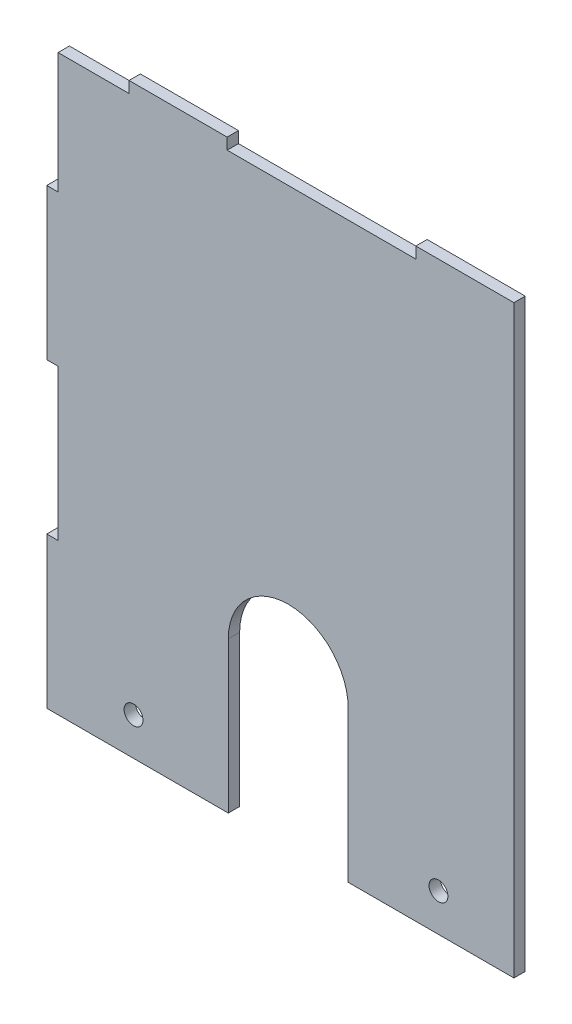
ISO-10303-21;
HEADER;
FILE_DESCRIPTION(('STEP AP214'),'2;1');
FILE_NAME('part.step','',(''),(''),'','','');
FILE_SCHEMA(('AUTOMOTIVE_DESIGN { 1 0 10303 214 1 1 1 1 }'));
ENDSEC;
DATA;
#1=APPLICATION_CONTEXT('core data for automotive mechanical design processes');
#2=APPLICATION_PROTOCOL_DEFINITION('international standard','automotive_design',2000,#1);
#3=PRODUCT_CONTEXT('',#1,'mechanical');
#4=PRODUCT('Part','Part','',(#3));
#5=PRODUCT_RELATED_PRODUCT_CATEGORY('part','',(#4));
#6=PRODUCT_DEFINITION_FORMATION('','',#4);
#7=PRODUCT_DEFINITION_CONTEXT('part definition',#1,'design');
#8=PRODUCT_DEFINITION('design','',#6,#7);
#9=PRODUCT_DEFINITION_SHAPE('','',#8);
#10=(LENGTH_UNIT() NAMED_UNIT(*) SI_UNIT(.MILLI.,.METRE.));
#11=(NAMED_UNIT(*) PLANE_ANGLE_UNIT() SI_UNIT($,.RADIAN.));
#12=(NAMED_UNIT(*) SI_UNIT($,.STERADIAN.) SOLID_ANGLE_UNIT());
#13=UNCERTAINTY_MEASURE_WITH_UNIT(LENGTH_MEASURE(1.E-05),#10,'distance_accuracy_value','');
#14=(GEOMETRIC_REPRESENTATION_CONTEXT(3) GLOBAL_UNCERTAINTY_ASSIGNED_CONTEXT((#13)) GLOBAL_UNIT_ASSIGNED_CONTEXT((#10,
#11,#12)) REPRESENTATION_CONTEXT('',''));
#15=CARTESIAN_POINT('',(0.,0.,0.));
#16=DIRECTION('',(0.,0.,1.));
#17=DIRECTION('',(1.,0.,0.));
#18=AXIS2_PLACEMENT_3D('',#15,#16,#17);
#19=CARTESIAN_POINT('',(0.56000000000009,-36.0440360897276,3.));
#20=DIRECTION('',(0.,0.,1.));
#21=DIRECTION('',(1.,0.,0.));
#22=AXIS2_PLACEMENT_3D('',#19,#20,#21);
#23=PLANE('',#22);
#24=CARTESIAN_POINT('',(-40.4399999999999,-66.0440360897276,3.));
#25=DIRECTION('',(0.,0.,1.));
#26=DIRECTION('',(1.,0.,0.));
#27=AXIS2_PLACEMENT_3D('',#24,#25,#26);
#28=CIRCLE('',#27,2.5);
#29=CARTESIAN_POINT('',(-37.9399999999999,-66.0440360897276,3.));
#30=VERTEX_POINT('',#29);
#31=EDGE_CURVE('E208',#30,#30,#28,.T.);
#32=ORIENTED_EDGE('',*,*,#31,.F.);
#33=EDGE_LOOP('',(#32));
#34=FACE_BOUND('',#33,.T.);
#35=DIRECTION('',(1.,0.,0.));
#36=VECTOR('',#35,1.);
#37=CARTESIAN_POINT('',(-60.4399999999999,-76.0440360897276,3.));
#38=LINE('',#37,#36);
#39=CARTESIAN_POINT('',(-63.4399999999999,-76.0440360897276,3.));
#40=VERTEX_POINT('',#39);
#41=CARTESIAN_POINT('',(-15.3243473367714,-76.0440360897276,3.));
#42=VERTEX_POINT('',#41);
#43=EDGE_CURVE('E132',#40,#42,#38,.T.);
#44=ORIENTED_EDGE('',*,*,#43,.T.);
#45=DIRECTION('',(0.,1.,0.));
#46=VECTOR('',#45,1.);
#47=CARTESIAN_POINT('',(-15.3243473367714,-36.0440360897276,3.));
#48=LINE('',#47,#46);
#49=CARTESIAN_POINT('',(-15.3243473367714,-36.0440360897276,3.));
#50=VERTEX_POINT('',#49);
#51=EDGE_CURVE('E353',#42,#50,#48,.T.);
#52=ORIENTED_EDGE('',*,*,#51,.T.);
#53=CARTESIAN_POINT('',(0.56000000000009,-36.0440360897276,3.));
#54=DIRECTION('',(0.,0.,-1.));
#55=DIRECTION('',(1.,0.,0.));
#56=AXIS2_PLACEMENT_3D('',#53,#54,#55);
#57=CIRCLE('',#56,15.8843473367715);
#58=CARTESIAN_POINT('',(16.4443473367716,-36.0440360897276,3.));
#59=VERTEX_POINT('',#58);
#60=EDGE_CURVE('E297',#50,#59,#57,.T.);
#61=ORIENTED_EDGE('',*,*,#60,.T.);
#62=DIRECTION('',(0.,-1.,0.));
#63=VECTOR('',#62,1.);
#64=CARTESIAN_POINT('',(16.4443473367716,-36.0440360897276,3.));
#65=LINE('',#64,#63);
#66=CARTESIAN_POINT('',(16.4443473367716,-76.0440360897275,3.));
#67=VERTEX_POINT('',#66);
#68=EDGE_CURVE('E315',#59,#67,#65,.T.);
#69=ORIENTED_EDGE('',*,*,#68,.T.);
#70=DIRECTION('',(1.,0.,0.));
#71=VECTOR('',#70,1.);
#72=CARTESIAN_POINT('',(60.3700000000001,-76.0440360897275,3.));
#73=LINE('',#72,#71);
#74=CARTESIAN_POINT('',(60.3700000000001,-76.0440360897275,3.));
#75=VERTEX_POINT('',#74);
#76=EDGE_CURVE('E312',#67,#75,#73,.T.);
#77=ORIENTED_EDGE('',*,*,#76,.T.);
#78=DIRECTION('',(0.,1.,0.));
#79=VECTOR('',#78,1.);
#80=CARTESIAN_POINT('',(60.3700000000001,75.9559639102725,3.));
#81=LINE('',#80,#79);
#82=CARTESIAN_POINT('',(60.3700000000001,78.9559639102725,3.));
#83=VERTEX_POINT('',#82);
#84=EDGE_CURVE('E314',#75,#83,#81,.T.);
#85=ORIENTED_EDGE('',*,*,#84,.T.);
#86=DIRECTION('',(-1.,0.,0.));
#87=VECTOR('',#86,1.);
#88=CARTESIAN_POINT('',(60.3700000000001,78.9559639102725,3.));
#89=LINE('',#88,#87);
#90=CARTESIAN_POINT('',(34.3700000000001,78.9559639102725,3.));
#91=VERTEX_POINT('',#90);
#92=EDGE_CURVE('E317',#83,#91,#89,.T.);
#93=ORIENTED_EDGE('',*,*,#92,.T.);
#94=DIRECTION('',(0.,-1.,0.));
#95=VECTOR('',#94,1.);
#96=CARTESIAN_POINT('',(34.3700000000001,78.9559639102725,3.));
#97=LINE('',#96,#95);
#98=CARTESIAN_POINT('',(34.3700000000001,75.9559639102724,3.));
#99=VERTEX_POINT('',#98);
#100=EDGE_CURVE('E323',#91,#99,#97,.T.);
#101=ORIENTED_EDGE('',*,*,#100,.T.);
#102=DIRECTION('',(-1.,0.,0.));
#103=VECTOR('',#102,1.);
#104=CARTESIAN_POINT('',(34.3700000000001,75.9559639102724,3.));
#105=LINE('',#104,#103);
#106=CARTESIAN_POINT('',(-15.6299999999999,75.9559639102725,3.));
#107=VERTEX_POINT('',#106);
#108=EDGE_CURVE('E325',#99,#107,#105,.T.);
#109=ORIENTED_EDGE('',*,*,#108,.T.);
#110=DIRECTION('',(0.,1.,0.));
#111=VECTOR('',#110,1.);
#112=CARTESIAN_POINT('',(-15.6299999999999,78.9559639102725,3.));
#113=LINE('',#112,#111);
#114=CARTESIAN_POINT('',(-15.6299999999999,78.9559639102725,3.));
#115=VERTEX_POINT('',#114);
#116=EDGE_CURVE('E327',#107,#115,#113,.T.);
#117=ORIENTED_EDGE('',*,*,#116,.T.);
#118=DIRECTION('',(-1.,0.,0.));
#119=VECTOR('',#118,1.);
#120=CARTESIAN_POINT('',(-41.6299999999999,78.9559639102725,3.));
#121=LINE('',#120,#119);
#122=CARTESIAN_POINT('',(-41.6299999999999,78.9559639102725,3.));
#123=VERTEX_POINT('',#122);
#124=EDGE_CURVE('E329',#115,#123,#121,.T.);
#125=ORIENTED_EDGE('',*,*,#124,.T.);
#126=DIRECTION('',(0.,-1.,0.));
#127=VECTOR('',#126,1.);
#128=CARTESIAN_POINT('',(-41.6299999999999,75.9559639102724,3.));
#129=LINE('',#128,#127);
#130=CARTESIAN_POINT('',(-41.6299999999999,75.9559639102724,3.));
#131=VERTEX_POINT('',#130);
#132=EDGE_CURVE('E331',#123,#131,#129,.T.);
#133=ORIENTED_EDGE('',*,*,#132,.T.);
#134=DIRECTION('',(-1.,0.,0.));
#135=VECTOR('',#134,1.);
#136=CARTESIAN_POINT('',(-41.6299999999999,75.9559639102724,3.));
#137=LINE('',#136,#135);
#138=CARTESIAN_POINT('',(-60.4399999999999,75.9559639102724,3.));
#139=VERTEX_POINT('',#138);
#140=EDGE_CURVE('E333',#131,#139,#137,.T.);
#141=ORIENTED_EDGE('',*,*,#140,.T.);
#142=DIRECTION('',(0.,-1.,0.));
#143=VECTOR('',#142,1.);
#144=CARTESIAN_POINT('',(-60.4399999999999,75.9559639102724,3.));
#145=LINE('',#144,#143);
#146=CARTESIAN_POINT('',(-60.4399999999999,43.9559639102724,3.));
#147=VERTEX_POINT('',#146);
#148=EDGE_CURVE('E335',#139,#147,#145,.T.);
#149=ORIENTED_EDGE('',*,*,#148,.T.);
#150=DIRECTION('',(-1.,0.,0.));
#151=VECTOR('',#150,1.);
#152=CARTESIAN_POINT('',(-60.4399999999999,43.9559639102724,3.));
#153=LINE('',#152,#151);
#154=CARTESIAN_POINT('',(-63.4399999999999,43.9559639102724,3.));
#155=VERTEX_POINT('',#154);
#156=EDGE_CURVE('E337',#147,#155,#153,.T.);
#157=ORIENTED_EDGE('',*,*,#156,.T.);
#158=DIRECTION('',(0.,-1.,0.));
#159=VECTOR('',#158,1.);
#160=CARTESIAN_POINT('',(-63.4399999999999,43.9559639102724,3.));
#161=LINE('',#160,#159);
#162=CARTESIAN_POINT('',(-63.4399999999999,3.95596391027241,3.));
#163=VERTEX_POINT('',#162);
#164=EDGE_CURVE('E339',#155,#163,#161,.T.);
#165=ORIENTED_EDGE('',*,*,#164,.T.);
#166=DIRECTION('',(1.,0.,0.));
#167=VECTOR('',#166,1.);
#168=CARTESIAN_POINT('',(-63.4399999999999,3.95596391027241,3.));
#169=LINE('',#168,#167);
#170=CARTESIAN_POINT('',(-60.4399999999999,3.95596391027241,3.));
#171=VERTEX_POINT('',#170);
#172=EDGE_CURVE('E188',#163,#171,#169,.T.);
#173=ORIENTED_EDGE('',*,*,#172,.T.);
#174=DIRECTION('',(0.,-1.,0.));
#175=VECTOR('',#174,1.);
#176=CARTESIAN_POINT('',(-60.4399999999999,3.95596391027241,3.));
#177=LINE('',#176,#175);
#178=CARTESIAN_POINT('',(-60.4399999999999,-36.0440360897276,3.));
#179=VERTEX_POINT('',#178);
#180=EDGE_CURVE('E182',#171,#179,#177,.T.);
#181=ORIENTED_EDGE('',*,*,#180,.T.);
#182=DIRECTION('',(-1.,0.,0.));
#183=VECTOR('',#182,1.);
#184=CARTESIAN_POINT('',(-63.4399999999999,-36.0440360897276,3.));
#185=LINE('',#184,#183);
#186=CARTESIAN_POINT('',(-63.4399999999999,-36.0440360897276,3.));
#187=VERTEX_POINT('',#186);
#188=EDGE_CURVE('E186',#179,#187,#185,.T.);
#189=ORIENTED_EDGE('',*,*,#188,.T.);
#190=DIRECTION('',(0.,-1.,0.));
#191=VECTOR('',#190,1.);
#192=CARTESIAN_POINT('',(-63.4399999999999,-76.0440360897276,3.));
#193=LINE('',#192,#191);
#194=EDGE_CURVE('E54',#187,#40,#193,.T.);
#195=ORIENTED_EDGE('',*,*,#194,.T.);
#196=EDGE_LOOP('',(#44,#52,#61,#69,#77,#85,#93,#101,#109,#117,#125,#133,#141,#149,#157,#165,
#173,#181,#189,#195));
#197=FACE_BOUND('',#196,.T.);
#198=CARTESIAN_POINT('',(40.3700000000001,-66.0440360897276,3.));
#199=DIRECTION('',(0.,0.,1.));
#200=DIRECTION('',(1.,0.,0.));
#201=AXIS2_PLACEMENT_3D('',#198,#199,#200);
#202=CIRCLE('',#201,2.5);
#203=CARTESIAN_POINT('',(42.8700000000001,-66.0440360897276,3.));
#204=VERTEX_POINT('',#203);
#205=EDGE_CURVE('E591',#204,#204,#202,.T.);
#206=ORIENTED_EDGE('',*,*,#205,.F.);
#207=EDGE_LOOP('',(#206));
#208=FACE_BOUND('',#207,.T.);
#209=ADVANCED_FACE('F37',(#34,#197,#208),#23,.T.);
#210=CARTESIAN_POINT('',(0.56000000000009,-36.0440360897276,0.));
#211=DIRECTION('',(0.,0.,1.));
#212=DIRECTION('',(1.,0.,0.));
#213=AXIS2_PLACEMENT_3D('',#210,#211,#212);
#214=PLANE('',#213);
#215=DIRECTION('',(1.,0.,0.));
#216=VECTOR('',#215,1.);
#217=CARTESIAN_POINT('',(-15.3243473367714,-76.0440360897276,0.));
#218=LINE('',#217,#216);
#219=CARTESIAN_POINT('',(-63.4399999999999,-76.0440360897276,0.));
#220=VERTEX_POINT('',#219);
#221=CARTESIAN_POINT('',(-15.3243473367714,-76.0440360897276,0.));
#222=VERTEX_POINT('',#221);
#223=EDGE_CURVE('E126',#220,#222,#218,.T.);
#224=ORIENTED_EDGE('',*,*,#223,.F.);
#225=DIRECTION('',(0.,-1.,0.));
#226=VECTOR('',#225,1.);
#227=CARTESIAN_POINT('',(-63.4399999999999,-76.0440360897276,0.));
#228=LINE('',#227,#226);
#229=CARTESIAN_POINT('',(-63.4399999999999,-36.0440360897276,0.));
#230=VERTEX_POINT('',#229);
#231=EDGE_CURVE('E243',#230,#220,#228,.T.);
#232=ORIENTED_EDGE('',*,*,#231,.F.);
#233=DIRECTION('',(-1.,0.,0.));
#234=VECTOR('',#233,1.);
#235=CARTESIAN_POINT('',(-63.4399999999999,-36.0440360897276,0.));
#236=LINE('',#235,#234);
#237=CARTESIAN_POINT('',(-60.4399999999999,-36.0440360897276,0.));
#238=VERTEX_POINT('',#237);
#239=EDGE_CURVE('E119',#238,#230,#236,.T.);
#240=ORIENTED_EDGE('',*,*,#239,.F.);
#241=DIRECTION('',(0.,-1.,0.));
#242=VECTOR('',#241,1.);
#243=CARTESIAN_POINT('',(-60.4399999999999,3.95596391027241,0.));
#244=LINE('',#243,#242);
#245=CARTESIAN_POINT('',(-60.4399999999999,3.95596391027241,0.));
#246=VERTEX_POINT('',#245);
#247=EDGE_CURVE('E196',#246,#238,#244,.T.);
#248=ORIENTED_EDGE('',*,*,#247,.F.);
#249=DIRECTION('',(1.,0.,0.));
#250=VECTOR('',#249,1.);
#251=CARTESIAN_POINT('',(-63.4399999999999,3.95596391027241,0.));
#252=LINE('',#251,#250);
#253=CARTESIAN_POINT('',(-63.4399999999999,3.95596391027241,0.));
#254=VERTEX_POINT('',#253);
#255=EDGE_CURVE('E239',#254,#246,#252,.T.);
#256=ORIENTED_EDGE('',*,*,#255,.F.);
#257=DIRECTION('',(0.,-1.,0.));
#258=VECTOR('',#257,1.);
#259=CARTESIAN_POINT('',(-63.4399999999999,43.9559639102724,0.));
#260=LINE('',#259,#258);
#261=CARTESIAN_POINT('',(-63.4399999999999,43.9559639102724,0.));
#262=VERTEX_POINT('',#261);
#263=EDGE_CURVE('E237',#262,#254,#260,.T.);
#264=ORIENTED_EDGE('',*,*,#263,.F.);
#265=DIRECTION('',(-1.,0.,0.));
#266=VECTOR('',#265,1.);
#267=CARTESIAN_POINT('',(-60.4399999999999,43.9559639102724,0.));
#268=LINE('',#267,#266);
#269=CARTESIAN_POINT('',(-60.4399999999999,43.9559639102724,0.));
#270=VERTEX_POINT('',#269);
#271=EDGE_CURVE('E235',#270,#262,#268,.T.);
#272=ORIENTED_EDGE('',*,*,#271,.F.);
#273=DIRECTION('',(0.,-1.,0.));
#274=VECTOR('',#273,1.);
#275=CARTESIAN_POINT('',(-60.4399999999999,75.9559639102724,0.));
#276=LINE('',#275,#274);
#277=CARTESIAN_POINT('',(-60.4399999999999,75.9559639102724,0.));
#278=VERTEX_POINT('',#277);
#279=EDGE_CURVE('E233',#278,#270,#276,.T.);
#280=ORIENTED_EDGE('',*,*,#279,.F.);
#281=DIRECTION('',(-1.,0.,0.));
#282=VECTOR('',#281,1.);
#283=CARTESIAN_POINT('',(-41.6299999999999,75.9559639102724,0.));
#284=LINE('',#283,#282);
#285=CARTESIAN_POINT('',(-41.6299999999999,75.9559639102724,0.));
#286=VERTEX_POINT('',#285);
#287=EDGE_CURVE('E231',#286,#278,#284,.T.);
#288=ORIENTED_EDGE('',*,*,#287,.F.);
#289=DIRECTION('',(0.,-1.,0.));
#290=VECTOR('',#289,1.);
#291=CARTESIAN_POINT('',(-41.6299999999999,75.9559639102724,0.));
#292=LINE('',#291,#290);
#293=CARTESIAN_POINT('',(-41.6299999999999,78.9559639102725,0.));
#294=VERTEX_POINT('',#293);
#295=EDGE_CURVE('E229',#294,#286,#292,.T.);
#296=ORIENTED_EDGE('',*,*,#295,.F.);
#297=DIRECTION('',(-1.,0.,0.));
#298=VECTOR('',#297,1.);
#299=CARTESIAN_POINT('',(-41.6299999999999,78.9559639102725,0.));
#300=LINE('',#299,#298);
#301=CARTESIAN_POINT('',(-15.6299999999999,78.9559639102725,0.));
#302=VERTEX_POINT('',#301);
#303=EDGE_CURVE('E227',#302,#294,#300,.T.);
#304=ORIENTED_EDGE('',*,*,#303,.F.);
#305=DIRECTION('',(0.,1.,0.));
#306=VECTOR('',#305,1.);
#307=CARTESIAN_POINT('',(-15.6299999999999,78.9559639102725,0.));
#308=LINE('',#307,#306);
#309=CARTESIAN_POINT('',(-15.6299999999999,75.9559639102725,0.));
#310=VERTEX_POINT('',#309);
#311=EDGE_CURVE('E225',#310,#302,#308,.T.);
#312=ORIENTED_EDGE('',*,*,#311,.F.);
#313=DIRECTION('',(-1.,0.,0.));
#314=VECTOR('',#313,1.);
#315=CARTESIAN_POINT('',(34.3700000000001,75.9559639102724,0.));
#316=LINE('',#315,#314);
#317=CARTESIAN_POINT('',(34.3700000000001,75.9559639102724,0.));
#318=VERTEX_POINT('',#317);
#319=EDGE_CURVE('E223',#318,#310,#316,.T.);
#320=ORIENTED_EDGE('',*,*,#319,.F.);
#321=DIRECTION('',(0.,-1.,0.));
#322=VECTOR('',#321,1.);
#323=CARTESIAN_POINT('',(34.3700000000001,78.9559639102725,0.));
#324=LINE('',#323,#322);
#325=CARTESIAN_POINT('',(34.3700000000001,78.9559639102725,0.));
#326=VERTEX_POINT('',#325);
#327=EDGE_CURVE('E221',#326,#318,#324,.T.);
#328=ORIENTED_EDGE('',*,*,#327,.F.);
#329=DIRECTION('',(-1.,0.,0.));
#330=VECTOR('',#329,1.);
#331=CARTESIAN_POINT('',(60.3700000000001,78.9559639102725,0.));
#332=LINE('',#331,#330);
#333=CARTESIAN_POINT('',(60.3700000000001,78.9559639102725,0.));
#334=VERTEX_POINT('',#333);
#335=EDGE_CURVE('E219',#334,#326,#332,.T.);
#336=ORIENTED_EDGE('',*,*,#335,.F.);
#337=DIRECTION('',(0.,1.,0.));
#338=VECTOR('',#337,1.);
#339=CARTESIAN_POINT('',(60.3700000000001,75.9559639102725,0.));
#340=LINE('',#339,#338);
#341=CARTESIAN_POINT('',(60.3700000000001,-76.0440360897275,0.));
#342=VERTEX_POINT('',#341);
#343=EDGE_CURVE('E217',#342,#334,#340,.T.);
#344=ORIENTED_EDGE('',*,*,#343,.F.);
#345=DIRECTION('',(1.,0.,0.));
#346=VECTOR('',#345,1.);
#347=CARTESIAN_POINT('',(60.3700000000001,-76.0440360897275,0.));
#348=LINE('',#347,#346);
#349=CARTESIAN_POINT('',(16.4443473367716,-76.0440360897275,0.));
#350=VERTEX_POINT('',#349);
#351=EDGE_CURVE('E214',#350,#342,#348,.T.);
#352=ORIENTED_EDGE('',*,*,#351,.F.);
#353=DIRECTION('',(0.,-1.,0.));
#354=VECTOR('',#353,1.);
#355=CARTESIAN_POINT('',(16.4443473367716,-36.0440360897276,0.));
#356=LINE('',#355,#354);
#357=CARTESIAN_POINT('',(16.4443473367716,-36.0440360897276,0.));
#358=VERTEX_POINT('',#357);
#359=EDGE_CURVE('E212',#358,#350,#356,.T.);
#360=ORIENTED_EDGE('',*,*,#359,.F.);
#361=CARTESIAN_POINT('',(0.56000000000009,-36.0440360897276,0.));
#362=DIRECTION('',(0.,0.,-1.));
#363=DIRECTION('',(1.,0.,0.));
#364=AXIS2_PLACEMENT_3D('',#361,#362,#363);
#365=CIRCLE('',#364,15.8843473367715);
#366=CARTESIAN_POINT('',(-15.3243473367714,-36.0440360897276,0.));
#367=VERTEX_POINT('',#366);
#368=EDGE_CURVE('E210',#367,#358,#365,.T.);
#369=ORIENTED_EDGE('',*,*,#368,.F.);
#370=DIRECTION('',(0.,1.,0.));
#371=VECTOR('',#370,1.);
#372=CARTESIAN_POINT('',(-15.3243473367714,-36.0440360897276,0.));
#373=LINE('',#372,#371);
#374=EDGE_CURVE('E207',#222,#367,#373,.T.);
#375=ORIENTED_EDGE('',*,*,#374,.F.);
#376=EDGE_LOOP('',(#224,#232,#240,#248,#256,#264,#272,#280,#288,#296,#304,#312,#320,#328,#336,
#344,#352,#360,#369,#375));
#377=FACE_BOUND('',#376,.T.);
#378=CARTESIAN_POINT('',(-40.4399999999999,-66.0440360897276,0.));
#379=DIRECTION('',(0.,0.,1.));
#380=DIRECTION('',(1.,0.,0.));
#381=AXIS2_PLACEMENT_3D('',#378,#379,#380);
#382=CIRCLE('',#381,2.5);
#383=CARTESIAN_POINT('',(-37.9399999999999,-66.0440360897276,0.));
#384=VERTEX_POINT('',#383);
#385=EDGE_CURVE('E357',#384,#384,#382,.T.);
#386=ORIENTED_EDGE('',*,*,#385,.T.);
#387=EDGE_LOOP('',(#386));
#388=FACE_BOUND('',#387,.T.);
#389=CARTESIAN_POINT('',(40.3700000000001,-66.0440360897276,0.));
#390=DIRECTION('',(0.,0.,1.));
#391=DIRECTION('',(1.,0.,0.));
#392=AXIS2_PLACEMENT_3D('',#389,#390,#391);
#393=CIRCLE('',#392,2.5);
#394=CARTESIAN_POINT('',(42.8700000000001,-66.0440360897276,0.));
#395=VERTEX_POINT('',#394);
#396=EDGE_CURVE('E594',#395,#395,#393,.T.);
#397=ORIENTED_EDGE('',*,*,#396,.T.);
#398=EDGE_LOOP('',(#397));
#399=FACE_BOUND('',#398,.T.);
#400=ADVANCED_FACE('F301',(#377,#388,#399),#214,.F.);
#401=CARTESIAN_POINT('',(-15.3243473367714,-76.0440360897276,3.));
#402=DIRECTION('',(0.,1.,0.));
#403=DIRECTION('',(0.,0.,1.));
#404=AXIS2_PLACEMENT_3D('',#401,#402,#403);
#405=PLANE('',#404);
#406=ORIENTED_EDGE('',*,*,#223,.T.);
#407=DIRECTION('',(0.,0.,-1.));
#408=VECTOR('',#407,1.);
#409=CARTESIAN_POINT('',(-15.3243473367714,-76.0440360897276,3.));
#410=LINE('',#409,#408);
#411=EDGE_CURVE('E11',#42,#222,#410,.T.);
#412=ORIENTED_EDGE('',*,*,#411,.F.);
#413=ORIENTED_EDGE('',*,*,#43,.F.);
#414=DIRECTION('',(0.,0.,-1.));
#415=VECTOR('',#414,1.);
#416=CARTESIAN_POINT('',(-63.4399999999999,-76.0440360897276,3.));
#417=LINE('',#416,#415);
#418=EDGE_CURVE('E202',#40,#220,#417,.T.);
#419=ORIENTED_EDGE('',*,*,#418,.T.);
#420=EDGE_LOOP('',(#406,#412,#413,#419));
#421=FACE_BOUND('',#420,.T.);
#422=ADVANCED_FACE('F39',(#421),#405,.F.);
#423=CARTESIAN_POINT('',(-15.3243473367714,-36.0440360897276,3.));
#424=DIRECTION('',(-1.,0.,0.));
#425=DIRECTION('',(0.,-1.,0.));
#426=AXIS2_PLACEMENT_3D('',#423,#424,#425);
#427=PLANE('',#426);
#428=ORIENTED_EDGE('',*,*,#374,.T.);
#429=DIRECTION('',(0.,0.,-1.));
#430=VECTOR('',#429,1.);
#431=CARTESIAN_POINT('',(-15.3243473367714,-36.0440360897276,3.));
#432=LINE('',#431,#430);
#433=EDGE_CURVE('E46',#50,#367,#432,.T.);
#434=ORIENTED_EDGE('',*,*,#433,.F.);
#435=ORIENTED_EDGE('',*,*,#51,.F.);
#436=ORIENTED_EDGE('',*,*,#411,.T.);
#437=EDGE_LOOP('',(#428,#434,#435,#436));
#438=FACE_BOUND('',#437,.T.);
#439=ADVANCED_FACE('F359',(#438),#427,.F.);
#440=CARTESIAN_POINT('',(0.56000000000009,-36.0440360897276,3.));
#441=DIRECTION('',(0.,0.,-1.));
#442=DIRECTION('',(-1.,0.,0.));
#443=AXIS2_PLACEMENT_3D('',#440,#441,#442);
#444=CYLINDRICAL_SURFACE('',#443,15.8843473367715);
#445=ORIENTED_EDGE('',*,*,#368,.T.);
#446=DIRECTION('',(0.,0.,-1.));
#447=VECTOR('',#446,1.);
#448=CARTESIAN_POINT('',(16.4443473367716,-36.0440360897276,3.));
#449=LINE('',#448,#447);
#450=EDGE_CURVE('E288',#59,#358,#449,.T.);
#451=ORIENTED_EDGE('',*,*,#450,.F.);
#452=ORIENTED_EDGE('',*,*,#60,.F.);
#453=ORIENTED_EDGE('',*,*,#433,.T.);
#454=EDGE_LOOP('',(#445,#451,#452,#453));
#455=FACE_BOUND('',#454,.T.);
#456=ADVANCED_FACE('F295',(#455),#444,.F.);
#457=CARTESIAN_POINT('',(16.4443473367716,-36.0440360897276,3.));
#458=DIRECTION('',(1.,0.,0.));
#459=DIRECTION('',(0.,0.,-1.));
#460=AXIS2_PLACEMENT_3D('',#457,#458,#459);
#461=PLANE('',#460);
#462=ORIENTED_EDGE('',*,*,#359,.T.);
#463=DIRECTION('',(0.,0.,-1.));
#464=VECTOR('',#463,1.);
#465=CARTESIAN_POINT('',(16.4443473367716,-76.0440360897275,3.));
#466=LINE('',#465,#464);
#467=EDGE_CURVE('E285',#67,#350,#466,.T.);
#468=ORIENTED_EDGE('',*,*,#467,.F.);
#469=ORIENTED_EDGE('',*,*,#68,.F.);
#470=ORIENTED_EDGE('',*,*,#450,.T.);
#471=EDGE_LOOP('',(#462,#468,#469,#470));
#472=FACE_BOUND('',#471,.T.);
#473=ADVANCED_FACE('F306',(#472),#461,.F.);
#474=CARTESIAN_POINT('',(60.3700000000001,-76.0440360897275,3.));
#475=DIRECTION('',(0.,1.,0.));
#476=DIRECTION('',(0.,0.,1.));
#477=AXIS2_PLACEMENT_3D('',#474,#475,#476);
#478=PLANE('',#477);
#479=ORIENTED_EDGE('',*,*,#351,.T.);
#480=DIRECTION('',(0.,0.,-1.));
#481=VECTOR('',#480,1.);
#482=CARTESIAN_POINT('',(60.3700000000001,-76.0440360897275,3.));
#483=LINE('',#482,#481);
#484=EDGE_CURVE('E282',#75,#342,#483,.T.);
#485=ORIENTED_EDGE('',*,*,#484,.F.);
#486=ORIENTED_EDGE('',*,*,#76,.F.);
#487=ORIENTED_EDGE('',*,*,#467,.T.);
#488=EDGE_LOOP('',(#479,#485,#486,#487));
#489=FACE_BOUND('',#488,.T.);
#490=ADVANCED_FACE('F310',(#489),#478,.F.);
#491=CARTESIAN_POINT('',(60.3700000000001,75.9559639102725,3.));
#492=DIRECTION('',(-1.,0.,0.));
#493=DIRECTION('',(0.,0.,1.));
#494=AXIS2_PLACEMENT_3D('',#491,#492,#493);
#495=PLANE('',#494);
#496=ORIENTED_EDGE('',*,*,#343,.T.);
#497=DIRECTION('',(0.,0.,-1.));
#498=VECTOR('',#497,1.);
#499=CARTESIAN_POINT('',(60.3700000000001,78.9559639102725,3.));
#500=LINE('',#499,#498);
#501=EDGE_CURVE('E279',#83,#334,#500,.T.);
#502=ORIENTED_EDGE('',*,*,#501,.F.);
#503=ORIENTED_EDGE('',*,*,#84,.F.);
#504=ORIENTED_EDGE('',*,*,#484,.T.);
#505=EDGE_LOOP('',(#496,#502,#503,#504));
#506=FACE_BOUND('',#505,.T.);
#507=ADVANCED_FACE('F423',(#506),#495,.F.);
#508=CARTESIAN_POINT('',(60.3700000000001,78.9559639102725,3.));
#509=DIRECTION('',(0.,-1.,0.));
#510=DIRECTION('',(0.,0.,-1.));
#511=AXIS2_PLACEMENT_3D('',#508,#509,#510);
#512=PLANE('',#511);
#513=ORIENTED_EDGE('',*,*,#335,.T.);
#514=DIRECTION('',(0.,0.,-1.));
#515=VECTOR('',#514,1.);
#516=CARTESIAN_POINT('',(34.3700000000001,78.9559639102725,3.));
#517=LINE('',#516,#515);
#518=EDGE_CURVE('E276',#91,#326,#517,.T.);
#519=ORIENTED_EDGE('',*,*,#518,.F.);
#520=ORIENTED_EDGE('',*,*,#92,.F.);
#521=ORIENTED_EDGE('',*,*,#501,.T.);
#522=EDGE_LOOP('',(#513,#519,#520,#521));
#523=FACE_BOUND('',#522,.T.);
#524=ADVANCED_FACE('F419',(#523),#512,.F.);
#525=CARTESIAN_POINT('',(34.3700000000001,78.9559639102725,3.));
#526=DIRECTION('',(1.,0.,0.));
#527=DIRECTION('',(0.,1.,0.));
#528=AXIS2_PLACEMENT_3D('',#525,#526,#527);
#529=PLANE('',#528);
#530=ORIENTED_EDGE('',*,*,#327,.T.);
#531=DIRECTION('',(0.,0.,-1.));
#532=VECTOR('',#531,1.);
#533=CARTESIAN_POINT('',(34.3700000000001,75.9559639102724,3.));
#534=LINE('',#533,#532);
#535=EDGE_CURVE('E273',#99,#318,#534,.T.);
#536=ORIENTED_EDGE('',*,*,#535,.F.);
#537=ORIENTED_EDGE('',*,*,#100,.F.);
#538=ORIENTED_EDGE('',*,*,#518,.T.);
#539=EDGE_LOOP('',(#530,#536,#537,#538));
#540=FACE_BOUND('',#539,.T.);
#541=ADVANCED_FACE('F415',(#540),#529,.F.);
#542=CARTESIAN_POINT('',(34.3700000000001,75.9559639102724,3.));
#543=DIRECTION('',(0.,-1.,0.));
#544=DIRECTION('',(1.,0.,0.));
#545=AXIS2_PLACEMENT_3D('',#542,#543,#544);
#546=PLANE('',#545);
#547=ORIENTED_EDGE('',*,*,#319,.T.);
#548=DIRECTION('',(0.,0.,-1.));
#549=VECTOR('',#548,1.);
#550=CARTESIAN_POINT('',(-15.6299999999999,75.9559639102725,3.));
#551=LINE('',#550,#549);
#552=EDGE_CURVE('E270',#107,#310,#551,.T.);
#553=ORIENTED_EDGE('',*,*,#552,.F.);
#554=ORIENTED_EDGE('',*,*,#108,.F.);
#555=ORIENTED_EDGE('',*,*,#535,.T.);
#556=EDGE_LOOP('',(#547,#553,#554,#555));
#557=FACE_BOUND('',#556,.T.);
#558=ADVANCED_FACE('F411',(#557),#546,.F.);
#559=CARTESIAN_POINT('',(-15.6299999999999,78.9559639102725,3.));
#560=DIRECTION('',(-1.,0.,0.));
#561=DIRECTION('',(0.,-1.,0.));
#562=AXIS2_PLACEMENT_3D('',#559,#560,#561);
#563=PLANE('',#562);
#564=ORIENTED_EDGE('',*,*,#311,.T.);
#565=DIRECTION('',(0.,0.,-1.));
#566=VECTOR('',#565,1.);
#567=CARTESIAN_POINT('',(-15.6299999999999,78.9559639102725,3.));
#568=LINE('',#567,#566);
#569=EDGE_CURVE('E267',#115,#302,#568,.T.);
#570=ORIENTED_EDGE('',*,*,#569,.F.);
#571=ORIENTED_EDGE('',*,*,#116,.F.);
#572=ORIENTED_EDGE('',*,*,#552,.T.);
#573=EDGE_LOOP('',(#564,#570,#571,#572));
#574=FACE_BOUND('',#573,.T.);
#575=ADVANCED_FACE('F407',(#574),#563,.F.);
#576=CARTESIAN_POINT('',(-41.6299999999999,78.9559639102725,3.));
#577=DIRECTION('',(0.,-1.,0.));
#578=DIRECTION('',(0.,0.,-1.));
#579=AXIS2_PLACEMENT_3D('',#576,#577,#578);
#580=PLANE('',#579);
#581=ORIENTED_EDGE('',*,*,#303,.T.);
#582=DIRECTION('',(0.,0.,-1.));
#583=VECTOR('',#582,1.);
#584=CARTESIAN_POINT('',(-41.6299999999999,78.9559639102725,3.));
#585=LINE('',#584,#583);
#586=EDGE_CURVE('E264',#123,#294,#585,.T.);
#587=ORIENTED_EDGE('',*,*,#586,.F.);
#588=ORIENTED_EDGE('',*,*,#124,.F.);
#589=ORIENTED_EDGE('',*,*,#569,.T.);
#590=EDGE_LOOP('',(#581,#587,#588,#589));
#591=FACE_BOUND('',#590,.T.);
#592=ADVANCED_FACE('F403',(#591),#580,.F.);
#593=CARTESIAN_POINT('',(-41.6299999999999,75.9559639102724,3.));
#594=DIRECTION('',(1.,0.,0.));
#595=DIRECTION('',(0.,0.,-1.));
#596=AXIS2_PLACEMENT_3D('',#593,#594,#595);
#597=PLANE('',#596);
#598=ORIENTED_EDGE('',*,*,#295,.T.);
#599=DIRECTION('',(0.,0.,-1.));
#600=VECTOR('',#599,1.);
#601=CARTESIAN_POINT('',(-41.6299999999999,75.9559639102724,3.));
#602=LINE('',#601,#600);
#603=EDGE_CURVE('E261',#131,#286,#602,.T.);
#604=ORIENTED_EDGE('',*,*,#603,.F.);
#605=ORIENTED_EDGE('',*,*,#132,.F.);
#606=ORIENTED_EDGE('',*,*,#586,.T.);
#607=EDGE_LOOP('',(#598,#604,#605,#606));
#608=FACE_BOUND('',#607,.T.);
#609=ADVANCED_FACE('F399',(#608),#597,.F.);
#610=CARTESIAN_POINT('',(-41.6299999999999,75.9559639102724,3.));
#611=DIRECTION('',(0.,-1.,0.));
#612=DIRECTION('',(0.,0.,-1.));
#613=AXIS2_PLACEMENT_3D('',#610,#611,#612);
#614=PLANE('',#613);
#615=ORIENTED_EDGE('',*,*,#287,.T.);
#616=DIRECTION('',(0.,0.,-1.));
#617=VECTOR('',#616,1.);
#618=CARTESIAN_POINT('',(-60.4399999999999,75.9559639102724,3.));
#619=LINE('',#618,#617);
#620=EDGE_CURVE('E258',#139,#278,#619,.T.);
#621=ORIENTED_EDGE('',*,*,#620,.F.);
#622=ORIENTED_EDGE('',*,*,#140,.F.);
#623=ORIENTED_EDGE('',*,*,#603,.T.);
#624=EDGE_LOOP('',(#615,#621,#622,#623));
#625=FACE_BOUND('',#624,.T.);
#626=ADVANCED_FACE('F395',(#625),#614,.F.);
#627=CARTESIAN_POINT('',(-60.4399999999999,75.9559639102724,3.));
#628=DIRECTION('',(1.,0.,0.));
#629=DIRECTION('',(0.,0.,-1.));
#630=AXIS2_PLACEMENT_3D('',#627,#628,#629);
#631=PLANE('',#630);
#632=ORIENTED_EDGE('',*,*,#279,.T.);
#633=DIRECTION('',(0.,0.,-1.));
#634=VECTOR('',#633,1.);
#635=CARTESIAN_POINT('',(-60.4399999999999,43.9559639102724,3.));
#636=LINE('',#635,#634);
#637=EDGE_CURVE('E255',#147,#270,#636,.T.);
#638=ORIENTED_EDGE('',*,*,#637,.F.);
#639=ORIENTED_EDGE('',*,*,#148,.F.);
#640=ORIENTED_EDGE('',*,*,#620,.T.);
#641=EDGE_LOOP('',(#632,#638,#639,#640));
#642=FACE_BOUND('',#641,.T.);
#643=ADVANCED_FACE('F391',(#642),#631,.F.);
#644=CARTESIAN_POINT('',(-60.4399999999999,43.9559639102724,3.));
#645=DIRECTION('',(0.,-1.,0.));
#646=DIRECTION('',(1.,0.,0.));
#647=AXIS2_PLACEMENT_3D('',#644,#645,#646);
#648=PLANE('',#647);
#649=ORIENTED_EDGE('',*,*,#271,.T.);
#650=DIRECTION('',(0.,0.,-1.));
#651=VECTOR('',#650,1.);
#652=CARTESIAN_POINT('',(-63.4399999999999,43.9559639102724,3.));
#653=LINE('',#652,#651);
#654=EDGE_CURVE('E252',#155,#262,#653,.T.);
#655=ORIENTED_EDGE('',*,*,#654,.F.);
#656=ORIENTED_EDGE('',*,*,#156,.F.);
#657=ORIENTED_EDGE('',*,*,#637,.T.);
#658=EDGE_LOOP('',(#649,#655,#656,#657));
#659=FACE_BOUND('',#658,.T.);
#660=ADVANCED_FACE('F388',(#659),#648,.F.);
#661=CARTESIAN_POINT('',(-63.4399999999999,43.9559639102724,3.));
#662=DIRECTION('',(1.,0.,0.));
#663=DIRECTION('',(0.,0.,-1.));
#664=AXIS2_PLACEMENT_3D('',#661,#662,#663);
#665=PLANE('',#664);
#666=ORIENTED_EDGE('',*,*,#263,.T.);
#667=DIRECTION('',(0.,0.,-1.));
#668=VECTOR('',#667,1.);
#669=CARTESIAN_POINT('',(-63.4399999999999,3.95596391027241,3.));
#670=LINE('',#669,#668);
#671=EDGE_CURVE('E249',#163,#254,#670,.T.);
#672=ORIENTED_EDGE('',*,*,#671,.F.);
#673=ORIENTED_EDGE('',*,*,#164,.F.);
#674=ORIENTED_EDGE('',*,*,#654,.T.);
#675=EDGE_LOOP('',(#666,#672,#673,#674));
#676=FACE_BOUND('',#675,.T.);
#677=ADVANCED_FACE('F345',(#676),#665,.F.);
#678=CARTESIAN_POINT('',(-63.4399999999999,3.95596391027241,3.));
#679=DIRECTION('',(0.,1.,0.));
#680=DIRECTION('',(0.,0.,1.));
#681=AXIS2_PLACEMENT_3D('',#678,#679,#680);
#682=PLANE('',#681);
#683=ORIENTED_EDGE('',*,*,#255,.T.);
#684=DIRECTION('',(0.,0.,-1.));
#685=VECTOR('',#684,1.);
#686=CARTESIAN_POINT('',(-60.4399999999999,3.95596391027241,3.));
#687=LINE('',#686,#685);
#688=EDGE_CURVE('E197',#171,#246,#687,.T.);
#689=ORIENTED_EDGE('',*,*,#688,.F.);
#690=ORIENTED_EDGE('',*,*,#172,.F.);
#691=ORIENTED_EDGE('',*,*,#671,.T.);
#692=EDGE_LOOP('',(#683,#689,#690,#691));
#693=FACE_BOUND('',#692,.T.);
#694=ADVANCED_FACE('F349',(#693),#682,.F.);
#695=CARTESIAN_POINT('',(-60.4399999999999,3.95596391027241,3.));
#696=DIRECTION('',(1.,0.,0.));
#697=DIRECTION('',(0.,0.,-1.));
#698=AXIS2_PLACEMENT_3D('',#695,#696,#697);
#699=PLANE('',#698);
#700=ORIENTED_EDGE('',*,*,#247,.T.);
#701=DIRECTION('',(0.,0.,-1.));
#702=VECTOR('',#701,1.);
#703=CARTESIAN_POINT('',(-60.4399999999999,-36.0440360897276,3.));
#704=LINE('',#703,#702);
#705=EDGE_CURVE('E193',#179,#238,#704,.T.);
#706=ORIENTED_EDGE('',*,*,#705,.F.);
#707=ORIENTED_EDGE('',*,*,#180,.F.);
#708=ORIENTED_EDGE('',*,*,#688,.T.);
#709=EDGE_LOOP('',(#700,#706,#707,#708));
#710=FACE_BOUND('',#709,.T.);
#711=ADVANCED_FACE('F194',(#710),#699,.F.);
#712=CARTESIAN_POINT('',(-63.4399999999999,-36.0440360897276,3.));
#713=DIRECTION('',(0.,-1.,0.));
#714=DIRECTION('',(0.,0.,-1.));
#715=AXIS2_PLACEMENT_3D('',#712,#713,#714);
#716=PLANE('',#715);
#717=ORIENTED_EDGE('',*,*,#239,.T.);
#718=DIRECTION('',(0.,0.,-1.));
#719=VECTOR('',#718,1.);
#720=CARTESIAN_POINT('',(-63.4399999999999,-36.0440360897276,3.));
#721=LINE('',#720,#719);
#722=EDGE_CURVE('E198',#187,#230,#721,.T.);
#723=ORIENTED_EDGE('',*,*,#722,.F.);
#724=ORIENTED_EDGE('',*,*,#188,.F.);
#725=ORIENTED_EDGE('',*,*,#705,.T.);
#726=EDGE_LOOP('',(#717,#723,#724,#725));
#727=FACE_BOUND('',#726,.T.);
#728=ADVANCED_FACE('F200',(#727),#716,.F.);
#729=CARTESIAN_POINT('',(-63.4399999999999,-76.0440360897276,3.));
#730=DIRECTION('',(1.,0.,0.));
#731=DIRECTION('',(0.,1.,0.));
#732=AXIS2_PLACEMENT_3D('',#729,#730,#731);
#733=PLANE('',#732);
#734=ORIENTED_EDGE('',*,*,#231,.T.);
#735=ORIENTED_EDGE('',*,*,#418,.F.);
#736=ORIENTED_EDGE('',*,*,#194,.F.);
#737=ORIENTED_EDGE('',*,*,#722,.T.);
#738=EDGE_LOOP('',(#734,#735,#736,#737));
#739=FACE_BOUND('',#738,.T.);
#740=ADVANCED_FACE('F351',(#739),#733,.F.);
#741=CARTESIAN_POINT('',(-40.4399999999999,-66.0440360897276,3.));
#742=DIRECTION('',(0.,0.,-1.));
#743=DIRECTION('',(-1.,0.,0.));
#744=AXIS2_PLACEMENT_3D('',#741,#742,#743);
#745=CYLINDRICAL_SURFACE('',#744,2.5);
#746=ORIENTED_EDGE('',*,*,#31,.T.);
#747=EDGE_LOOP('',(#746));
#748=FACE_BOUND('',#747,.T.);
#749=ORIENTED_EDGE('',*,*,#385,.F.);
#750=EDGE_LOOP('',(#749));
#751=FACE_BOUND('',#750,.T.);
#752=ADVANCED_FACE('F375',(#748,#751),#745,.F.);
#753=CARTESIAN_POINT('',(40.3700000000001,-66.0440360897276,3.));
#754=DIRECTION('',(0.,0.,-1.));
#755=DIRECTION('',(-1.,0.,0.));
#756=AXIS2_PLACEMENT_3D('',#753,#754,#755);
#757=CYLINDRICAL_SURFACE('',#756,2.5);
#758=ORIENTED_EDGE('',*,*,#205,.T.);
#759=EDGE_LOOP('',(#758));
#760=FACE_BOUND('',#759,.T.);
#761=ORIENTED_EDGE('',*,*,#396,.F.);
#762=EDGE_LOOP('',(#761));
#763=FACE_BOUND('',#762,.T.);
#764=ADVANCED_FACE('F505',(#760,#763),#757,.F.);
#765=CLOSED_SHELL('',(#209,#400,#422,#439,#456,#473,#490,#507,#524,#541,#558,#575,#592,#609,
#626,#643,#660,#677,#694,#711,#728,#740,#752,#764));
#766=MANIFOLD_SOLID_BREP('B2',#765);
#767=ADVANCED_BREP_SHAPE_REPRESENTATION('',(#18,#766),#14);
#768=SHAPE_DEFINITION_REPRESENTATION(#9,#767);
ENDSEC;
END-ISO-10303-21;
